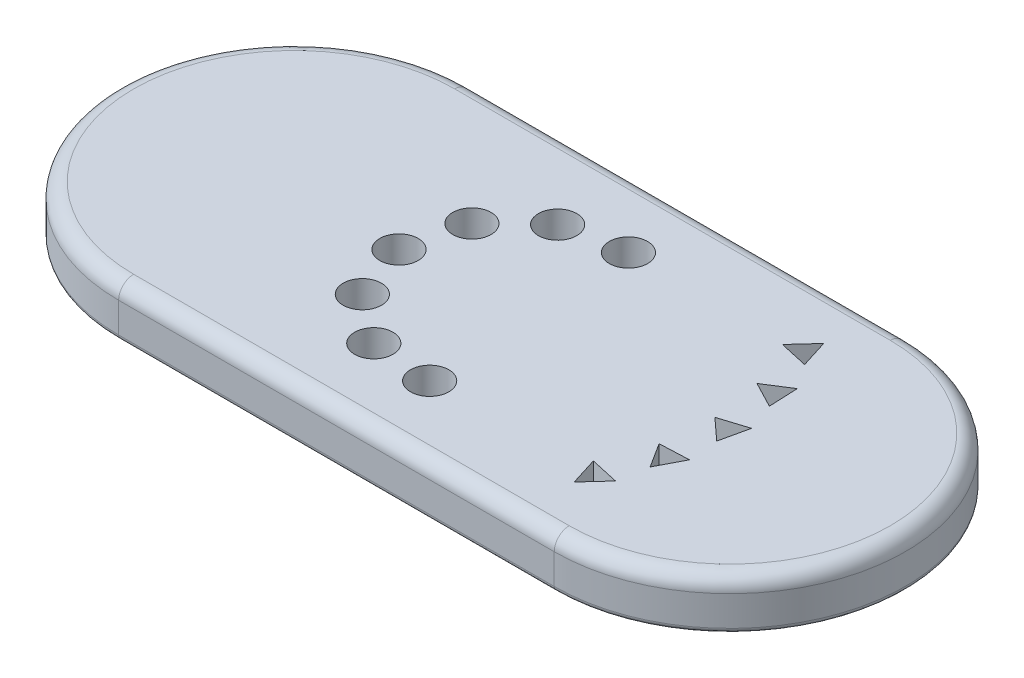
ISO-10303-21;
HEADER;
FILE_DESCRIPTION(('STEP AP214'),'2;1');
FILE_NAME('part.step','',(''),(''),'','','');
FILE_SCHEMA(('AUTOMOTIVE_DESIGN { 1 0 10303 214 1 1 1 1 }'));
ENDSEC;
DATA;
#1=APPLICATION_CONTEXT('core data for automotive mechanical design processes');
#2=APPLICATION_PROTOCOL_DEFINITION('international standard','automotive_design',2000,#1);
#3=PRODUCT_CONTEXT('',#1,'mechanical');
#4=PRODUCT('Part','Part','',(#3));
#5=PRODUCT_RELATED_PRODUCT_CATEGORY('part','',(#4));
#6=PRODUCT_DEFINITION_FORMATION('','',#4);
#7=PRODUCT_DEFINITION_CONTEXT('part definition',#1,'design');
#8=PRODUCT_DEFINITION('design','',#6,#7);
#9=PRODUCT_DEFINITION_SHAPE('','',#8);
#10=(LENGTH_UNIT() NAMED_UNIT(*) SI_UNIT(.MILLI.,.METRE.));
#11=(NAMED_UNIT(*) PLANE_ANGLE_UNIT() SI_UNIT($,.RADIAN.));
#12=(NAMED_UNIT(*) SI_UNIT($,.STERADIAN.) SOLID_ANGLE_UNIT());
#13=UNCERTAINTY_MEASURE_WITH_UNIT(LENGTH_MEASURE(1.E-05),#10,'distance_accuracy_value','');
#14=(GEOMETRIC_REPRESENTATION_CONTEXT(3) GLOBAL_UNCERTAINTY_ASSIGNED_CONTEXT((#13)) GLOBAL_UNIT_ASSIGNED_CONTEXT((#10,
#11,#12)) REPRESENTATION_CONTEXT('',''));
#15=CARTESIAN_POINT('',(0.,0.,0.));
#16=DIRECTION('',(0.,0.,1.));
#17=DIRECTION('',(1.,0.,0.));
#18=AXIS2_PLACEMENT_3D('',#15,#16,#17);
#19=CARTESIAN_POINT('',(-45.6671207444576,10.,0.));
#20=DIRECTION('',(0.,-1.,0.));
#21=DIRECTION('',(0.,0.,-1.));
#22=AXIS2_PLACEMENT_3D('',#19,#20,#21);
#23=CYLINDRICAL_SURFACE('',#22,35.0776434703805);
#24=DIRECTION('',(0.,-1.,0.));
#25=VECTOR('',#24,1.);
#26=CARTESIAN_POINT('',(-45.6671207444576,10.,-35.0776434703805));
#27=LINE('',#26,#25);
#28=CARTESIAN_POINT('',(-45.6671207444576,7.,-35.0776434703805));
#29=VERTEX_POINT('',#28);
#30=CARTESIAN_POINT('',(-45.6671207444576,0.999999999999999,-35.0776434703805));
#31=VERTEX_POINT('',#30);
#32=EDGE_CURVE('E429',#29,#31,#27,.T.);
#33=ORIENTED_EDGE('',*,*,#32,.T.);
#34=CARTESIAN_POINT('',(-45.6671207444576,0.999999999999999,0.));
#35=DIRECTION('',(0.,1.,0.));
#36=DIRECTION('',(0.,0.,1.));
#37=AXIS2_PLACEMENT_3D('',#34,#35,#36);
#38=CIRCLE('',#37,35.0776434703805);
#39=CARTESIAN_POINT('',(-45.6671207444576,0.999999999999999,35.0776434703805));
#40=VERTEX_POINT('',#39);
#41=EDGE_CURVE('E471',#31,#40,#38,.T.);
#42=ORIENTED_EDGE('',*,*,#41,.T.);
#43=DIRECTION('',(0.,-1.,0.));
#44=VECTOR('',#43,1.);
#45=CARTESIAN_POINT('',(-45.6671207444576,10.,35.0776434703805));
#46=LINE('',#45,#44);
#47=CARTESIAN_POINT('',(-45.6671207444576,7.,35.0776434703805));
#48=VERTEX_POINT('',#47);
#49=EDGE_CURVE('E442',#48,#40,#46,.T.);
#50=ORIENTED_EDGE('',*,*,#49,.F.);
#51=CARTESIAN_POINT('',(-45.6671207444576,7.,0.));
#52=DIRECTION('',(0.,1.,0.));
#53=DIRECTION('',(0.,0.,1.));
#54=AXIS2_PLACEMENT_3D('',#51,#52,#53);
#55=CIRCLE('',#54,35.0776434703805);
#56=EDGE_CURVE('E458',#48,#29,#55,.F.);
#57=ORIENTED_EDGE('',*,*,#56,.T.);
#58=EDGE_LOOP('',(#33,#42,#50,#57));
#59=FACE_BOUND('',#58,.T.);
#60=ADVANCED_FACE('F42',(#59),#23,.T.);
#61=CARTESIAN_POINT('',(-45.6671207444576,10.,35.0776434703805));
#62=DIRECTION('',(0.,0.,-1.));
#63=DIRECTION('',(-1.,0.,0.));
#64=AXIS2_PLACEMENT_3D('',#61,#62,#63);
#65=PLANE('',#64);
#66=ORIENTED_EDGE('',*,*,#49,.T.);
#67=DIRECTION('',(1.,0.,0.));
#68=VECTOR('',#67,1.);
#69=CARTESIAN_POINT('',(-45.6671207444576,0.999999999999999,35.0776434703805));
#70=LINE('',#69,#68);
#71=CARTESIAN_POINT('',(41.3651456018638,0.999999999999999,35.0776434703805));
#72=VERTEX_POINT('',#71);
#73=EDGE_CURVE('E12',#40,#72,#70,.T.);
#74=ORIENTED_EDGE('',*,*,#73,.T.);
#75=DIRECTION('',(0.,-1.,0.));
#76=VECTOR('',#75,1.);
#77=CARTESIAN_POINT('',(41.3651456018638,10.,35.0776434703805));
#78=LINE('',#77,#76);
#79=CARTESIAN_POINT('',(41.3651456018638,7.,35.0776434703805));
#80=VERTEX_POINT('',#79);
#81=EDGE_CURVE('E439',#80,#72,#78,.T.);
#82=ORIENTED_EDGE('',*,*,#81,.F.);
#83=DIRECTION('',(1.,0.,0.));
#84=VECTOR('',#83,1.);
#85=CARTESIAN_POINT('',(-45.6671207444576,7.,35.0776434703805));
#86=LINE('',#85,#84);
#87=EDGE_CURVE('E468',#80,#48,#86,.F.);
#88=ORIENTED_EDGE('',*,*,#87,.T.);
#89=EDGE_LOOP('',(#66,#74,#82,#88));
#90=FACE_BOUND('',#89,.T.);
#91=ADVANCED_FACE('F538',(#90),#65,.F.);
#92=CARTESIAN_POINT('',(41.3651456018638,10.,0.));
#93=DIRECTION('',(0.,-1.,0.));
#94=DIRECTION('',(0.,0.,-1.));
#95=AXIS2_PLACEMENT_3D('',#92,#93,#94);
#96=CYLINDRICAL_SURFACE('',#95,35.0776434703805);
#97=ORIENTED_EDGE('',*,*,#81,.T.);
#98=CARTESIAN_POINT('',(41.3651456018638,0.999999999999999,0.));
#99=DIRECTION('',(0.,1.,0.));
#100=DIRECTION('',(0.,0.,1.));
#101=AXIS2_PLACEMENT_3D('',#98,#99,#100);
#102=CIRCLE('',#101,35.0776434703805);
#103=CARTESIAN_POINT('',(41.3651456018638,0.999999999999999,-35.0776434703805));
#104=VERTEX_POINT('',#103);
#105=EDGE_CURVE('E52',#72,#104,#102,.T.);
#106=ORIENTED_EDGE('',*,*,#105,.T.);
#107=DIRECTION('',(0.,-1.,0.));
#108=VECTOR('',#107,1.);
#109=CARTESIAN_POINT('',(41.3651456018638,10.,-35.0776434703805));
#110=LINE('',#109,#108);
#111=CARTESIAN_POINT('',(41.3651456018638,7.,-35.0776434703805));
#112=VERTEX_POINT('',#111);
#113=EDGE_CURVE('E436',#112,#104,#110,.T.);
#114=ORIENTED_EDGE('',*,*,#113,.F.);
#115=CARTESIAN_POINT('',(41.3651456018638,7.,0.));
#116=DIRECTION('',(0.,1.,0.));
#117=DIRECTION('',(0.,0.,1.));
#118=AXIS2_PLACEMENT_3D('',#115,#116,#117);
#119=CIRCLE('',#118,35.0776434703805);
#120=EDGE_CURVE('E465',#112,#80,#119,.F.);
#121=ORIENTED_EDGE('',*,*,#120,.T.);
#122=EDGE_LOOP('',(#97,#106,#114,#121));
#123=FACE_BOUND('',#122,.T.);
#124=ADVANCED_FACE('F553',(#123),#96,.T.);
#125=CARTESIAN_POINT('',(-45.6671207444576,10.,-35.0776434703805));
#126=DIRECTION('',(0.,0.,1.));
#127=DIRECTION('',(1.,0.,0.));
#128=AXIS2_PLACEMENT_3D('',#125,#126,#127);
#129=PLANE('',#128);
#130=ORIENTED_EDGE('',*,*,#113,.T.);
#131=DIRECTION('',(-1.,0.,0.));
#132=VECTOR('',#131,1.);
#133=CARTESIAN_POINT('',(-45.6671207444576,0.999999999999999,-35.0776434703805));
#134=LINE('',#133,#132);
#135=EDGE_CURVE('E501',#104,#31,#134,.T.);
#136=ORIENTED_EDGE('',*,*,#135,.T.);
#137=ORIENTED_EDGE('',*,*,#32,.F.);
#138=DIRECTION('',(-1.,0.,0.));
#139=VECTOR('',#138,1.);
#140=CARTESIAN_POINT('',(41.3651456018638,7.,-35.0776434703805));
#141=LINE('',#140,#139);
#142=EDGE_CURVE('E462',#29,#112,#141,.F.);
#143=ORIENTED_EDGE('',*,*,#142,.T.);
#144=EDGE_LOOP('',(#130,#136,#137,#143));
#145=FACE_BOUND('',#144,.T.);
#146=ADVANCED_FACE('F551',(#145),#129,.F.);
#147=CARTESIAN_POINT('',(-45.6671207444576,10.,0.));
#148=DIRECTION('',(0.,1.,0.));
#149=DIRECTION('',(0.,0.,1.));
#150=AXIS2_PLACEMENT_3D('',#147,#148,#149);
#151=PLANE('',#150);
#152=DIRECTION('',(-1.,0.,0.));
#153=VECTOR('',#152,1.);
#154=CARTESIAN_POINT('',(-45.6671207444576,10.,-32.0776434703805));
#155=LINE('',#154,#153);
#156=CARTESIAN_POINT('',(41.3651456018638,10.,-32.0776434703805));
#157=VERTEX_POINT('',#156);
#158=CARTESIAN_POINT('',(-45.6671207444576,10.,-32.0776434703805));
#159=VERTEX_POINT('',#158);
#160=EDGE_CURVE('E451',#157,#159,#155,.T.);
#161=ORIENTED_EDGE('',*,*,#160,.T.);
#162=CARTESIAN_POINT('',(-45.6671207444576,10.,0.));
#163=DIRECTION('',(0.,1.,0.));
#164=DIRECTION('',(0.,0.,1.));
#165=AXIS2_PLACEMENT_3D('',#162,#163,#164);
#166=CIRCLE('',#165,32.0776434703805);
#167=CARTESIAN_POINT('',(-45.6671207444576,10.,32.0776434703805));
#168=VERTEX_POINT('',#167);
#169=EDGE_CURVE('E454',#159,#168,#166,.T.);
#170=ORIENTED_EDGE('',*,*,#169,.T.);
#171=DIRECTION('',(1.,0.,0.));
#172=VECTOR('',#171,1.);
#173=CARTESIAN_POINT('',(41.3651456018638,10.,32.0776434703805));
#174=LINE('',#173,#172);
#175=CARTESIAN_POINT('',(41.3651456018638,10.,32.0776434703805));
#176=VERTEX_POINT('',#175);
#177=EDGE_CURVE('E445',#168,#176,#174,.T.);
#178=ORIENTED_EDGE('',*,*,#177,.T.);
#179=CARTESIAN_POINT('',(41.3651456018638,10.,0.));
#180=DIRECTION('',(0.,1.,0.));
#181=DIRECTION('',(0.,0.,1.));
#182=AXIS2_PLACEMENT_3D('',#179,#180,#181);
#183=CIRCLE('',#182,32.0776434703805);
#184=EDGE_CURVE('E448',#176,#157,#183,.T.);
#185=ORIENTED_EDGE('',*,*,#184,.T.);
#186=EDGE_LOOP('',(#161,#170,#178,#185));
#187=FACE_BOUND('',#186,.T.);
#188=DIRECTION('',(0.886926625080922,0.,0.46191033948437));
#189=VECTOR('',#188,1.);
#190=CARTESIAN_POINT('',(35.4999934267407,10.,-11.2999352261753));
#191=LINE('',#190,#189);
#192=CARTESIAN_POINT('',(35.4999934267407,10.,-11.2999352261753));
#193=VERTEX_POINT('',#192);
#194=CARTESIAN_POINT('',(40.6730239839336,10.,-8.60582701782381));
#195=VERTEX_POINT('',#194);
#196=EDGE_CURVE('E207',#193,#195,#191,.T.);
#197=ORIENTED_EDGE('',*,*,#196,.F.);
#198=DIRECTION('',(-0.84348940080462,0.,0.537145818870689));
#199=VECTOR('',#198,1.);
#200=CARTESIAN_POINT('',(40.4196748543137,10.,-14.4328569990817));
#201=LINE('',#200,#199);
#202=CARTESIAN_POINT('',(40.4196748543137,10.,-14.4328569990817));
#203=VERTEX_POINT('',#202);
#204=EDGE_CURVE('E225',#203,#193,#201,.T.);
#205=ORIENTED_EDGE('',*,*,#204,.F.);
#206=DIRECTION('',(-0.0434372242763021,0.,-0.99905615835506));
#207=VECTOR('',#206,1.);
#208=CARTESIAN_POINT('',(40.6730239839336,10.,-8.60582701782381));
#209=LINE('',#208,#207);
#210=EDGE_CURVE('E229',#195,#203,#209,.T.);
#211=ORIENTED_EDGE('',*,*,#210,.F.);
#212=EDGE_LOOP('',(#197,#205,#211));
#213=FACE_BOUND('',#212,.T.);
#214=DIRECTION('',(0.737154140200738,0.,0.675724628517351));
#215=VECTOR('',#214,1.);
#216=CARTESIAN_POINT('',(37.15387447768,10.,-1.23903630891365));
#217=LINE('',#216,#215);
#218=CARTESIAN_POINT('',(37.15387447768,10.,-1.23903630891365));
#219=VERTEX_POINT('',#218);
#220=CARTESIAN_POINT('',(41.4533517791667,10.,2.70215121744924));
#221=VERTEX_POINT('',#220);
#222=EDGE_CURVE('E259',#219,#221,#217,.T.);
#223=ORIENTED_EDGE('',*,*,#222,.F.);
#224=DIRECTION('',(-0.953771764359197,0.,0.300531897660038));
#225=VECTOR('',#224,1.);
#226=CARTESIAN_POINT('',(42.7167816473319,10.,-2.99189911181428));
#227=LINE('',#226,#225);
#228=CARTESIAN_POINT('',(42.7167816473319,10.,-2.99189911181428));
#229=VERTEX_POINT('',#228);
#230=EDGE_CURVE('E250',#229,#219,#227,.T.);
#231=ORIENTED_EDGE('',*,*,#230,.F.);
#232=DIRECTION('',(0.216617624158459,0.,-0.97625652617739));
#233=VECTOR('',#232,1.);
#234=CARTESIAN_POINT('',(41.4533517791667,10.,2.70215121744924));
#235=LINE('',#234,#233);
#236=EDGE_CURVE('E262',#221,#229,#235,.T.);
#237=ORIENTED_EDGE('',*,*,#236,.F.);
#238=EDGE_LOOP('',(#223,#231,#237));
#239=FACE_BOUND('',#238,.T.);
#240=DIRECTION('',(0.537145818870688,0.,0.843489400804621));
#241=VECTOR('',#240,1.);
#242=CARTESIAN_POINT('',(36.1474486477536,10.,8.90710170527034));
#243=LINE('',#242,#241);
#244=CARTESIAN_POINT('',(36.1474486477536,10.,8.90710170527034));
#245=VERTEX_POINT('',#244);
#246=CARTESIAN_POINT('',(39.2803704206601,10.,13.8267831328433));
#247=VERTEX_POINT('',#246);
#248=EDGE_CURVE('E292',#245,#247,#243,.T.);
#249=ORIENTED_EDGE('',*,*,#248,.F.);
#250=DIRECTION('',(-0.99905615835506,0.,0.0434372242762998));
#251=VECTOR('',#250,1.);
#252=CARTESIAN_POINT('',(41.9744786290116,10.,8.65375257565046));
#253=LINE('',#252,#251);
#254=CARTESIAN_POINT('',(41.9744786290116,10.,8.65375257565046));
#255=VERTEX_POINT('',#254);
#256=EDGE_CURVE('E283',#255,#245,#253,.T.);
#257=ORIENTED_EDGE('',*,*,#256,.F.);
#258=DIRECTION('',(0.461910339484371,0.,-0.886926625080921));
#259=VECTOR('',#258,1.);
#260=CARTESIAN_POINT('',(39.2803704206601,10.,13.8267831328433));
#261=LINE('',#260,#259);
#262=EDGE_CURVE('E295',#247,#255,#261,.T.);
#263=ORIENTED_EDGE('',*,*,#262,.F.);
#264=EDGE_LOOP('',(#249,#257,#263));
#265=FACE_BOUND('',#264,.T.);
#266=DIRECTION('',(0.300531897660038,0.,0.953771764359198));
#267=VECTOR('',#266,1.);
#268=CARTESIAN_POINT('',(32.5493021940739,10.,18.4470362779959));
#269=LINE('',#268,#267);
#270=CARTESIAN_POINT('',(32.5493021940739,10.,18.4470362779959));
#271=VERTEX_POINT('',#270);
#272=CARTESIAN_POINT('',(34.3021649969745,10.,24.0099434476479));
#273=VERTEX_POINT('',#272);
#274=EDGE_CURVE('E325',#271,#273,#269,.T.);
#275=ORIENTED_EDGE('',*,*,#274,.F.);
#276=DIRECTION('',(-0.976256526177389,0.,-0.216617624158461));
#277=VECTOR('',#276,1.);
#278=CARTESIAN_POINT('',(38.2433525233374,10.,19.7104661461611));
#279=LINE('',#278,#277);
#280=CARTESIAN_POINT('',(38.2433525233374,10.,19.7104661461611));
#281=VERTEX_POINT('',#280);
#282=EDGE_CURVE('E316',#281,#271,#279,.T.);
#283=ORIENTED_EDGE('',*,*,#282,.F.);
#284=DIRECTION('',(0.675724628517351,0.,-0.737154140200737));
#285=VECTOR('',#284,1.);
#286=CARTESIAN_POINT('',(34.3021649969745,10.,24.0099434476479));
#287=LINE('',#286,#285);
#288=EDGE_CURVE('E328',#273,#281,#287,.T.);
#289=ORIENTED_EDGE('',*,*,#288,.F.);
#290=EDGE_LOOP('',(#275,#283,#289));
#291=FACE_BOUND('',#290,.T.);
#292=DIRECTION('',(0.97625652617739,0.,0.216617624158458));
#293=VECTOR('',#292,1.);
#294=CARTESIAN_POINT('',(31.2985147553897,10.,-20.5899614117248));
#295=LINE('',#294,#293);
#296=CARTESIAN_POINT('',(31.2985147553897,10.,-20.5899614117248));
#297=VERTEX_POINT('',#296);
#298=CARTESIAN_POINT('',(36.9925650846533,10.,-19.3265315435595));
#299=VERTEX_POINT('',#298);
#300=EDGE_CURVE('E242',#297,#299,#295,.T.);
#301=ORIENTED_EDGE('',*,*,#300,.F.);
#302=DIRECTION('',(-0.67572462851735,0.,0.737154140200738));
#303=VECTOR('',#302,1.);
#304=CARTESIAN_POINT('',(35.2397022817526,10.,-24.8894387132115));
#305=LINE('',#304,#303);
#306=CARTESIAN_POINT('',(35.2397022817526,10.,-24.8894387132115));
#307=VERTEX_POINT('',#306);
#308=EDGE_CURVE('E349',#307,#297,#305,.T.);
#309=ORIENTED_EDGE('',*,*,#308,.F.);
#310=DIRECTION('',(-0.300531897660041,0.,-0.953771764359197));
#311=VECTOR('',#310,1.);
#312=CARTESIAN_POINT('',(36.9925650846533,10.,-19.3265315435595));
#313=LINE('',#312,#311);
#314=EDGE_CURVE('E360',#299,#307,#313,.T.);
#315=ORIENTED_EDGE('',*,*,#314,.F.);
#316=EDGE_LOOP('',(#301,#309,#315));
#317=FACE_BOUND('',#316,.T.);
#318=CARTESIAN_POINT('',(-11.9019677543946,10.,-18.8695098053727));
#319=DIRECTION('',(0.,1.,0.));
#320=DIRECTION('',(0.544639035015028,0.,0.838670567945423));
#321=AXIS2_PLACEMENT_3D('',#318,#319,#320);
#322=CIRCLE('',#321,3.82970639069155);
#323=CARTESIAN_POINT('',(-9.81616016137746,10.,-15.6576477716272));
#324=VERTEX_POINT('',#323);
#325=EDGE_CURVE('E382',#324,#324,#322,.T.);
#326=ORIENTED_EDGE('',*,*,#325,.F.);
#327=EDGE_LOOP('',(#326));
#328=FACE_BOUND('',#327,.T.);
#329=CARTESIAN_POINT('',(-20.6609172871312,10.,-10.5041626997556));
#330=DIRECTION('',(0.,1.,0.));
#331=DIRECTION('',(0.913545457642602,0.,0.406736643075798));
#332=AXIS2_PLACEMENT_3D('',#329,#330,#331);
#333=CIRCLE('',#332,3.82970639069155);
#334=CARTESIAN_POINT('',(-17.1623064098101,10.,-8.94648077843977));
#335=VERTEX_POINT('',#334);
#336=EDGE_CURVE('E390',#335,#335,#333,.T.);
#337=ORIENTED_EDGE('',*,*,#336,.F.);
#338=EDGE_LOOP('',(#337));
#339=FACE_BOUND('',#338,.T.);
#340=CARTESIAN_POINT('',(-23.4506958911877,10.,1.28207352962794));
#341=DIRECTION('',(0.,1.,0.));
#342=DIRECTION('',(0.987688340595137,0.,-0.156434465040234));
#343=AXIS2_PLACEMENT_3D('',#340,#341,#342);
#344=CIRCLE('',#343,3.82970639069155);
#345=CARTESIAN_POINT('',(-19.668139541199,10.,0.682975459138944));
#346=VERTEX_POINT('',#345);
#347=EDGE_CURVE('E398',#346,#346,#344,.T.);
#348=ORIENTED_EDGE('',*,*,#347,.F.);
#349=EDGE_LOOP('',(#348));
#350=FACE_BOUND('',#349,.T.);
#351=CARTESIAN_POINT('',(-19.3711567710631,10.,12.6862652888828));
#352=DIRECTION('',(0.,1.,0.));
#353=DIRECTION('',(0.743144825477392,0.,-0.669130606358861));
#354=AXIS2_PLACEMENT_3D('',#351,#352,#353);
#355=CIRCLE('',#354,3.82970639069155);
#356=CARTESIAN_POINT('',(-16.525130283723,10.,10.123691529503));
#357=VERTEX_POINT('',#356);
#358=EDGE_CURVE('E406',#357,#357,#355,.T.);
#359=ORIENTED_EDGE('',*,*,#358,.F.);
#360=EDGE_LOOP('',(#359));
#361=FACE_BOUND('',#360,.T.);
#362=CARTESIAN_POINT('',(-9.73859938534576,10.,20.0287490188849));
#363=DIRECTION('',(0.,1.,0.));
#364=DIRECTION('',(0.258819045102516,0.,-0.96592582628907));
#365=AXIS2_PLACEMENT_3D('',#362,#363,#364);
#366=CIRCLE('',#365,3.82970639069155);
#367=CARTESIAN_POINT('',(-8.74739843428397,10.,16.3295367090117));
#368=VERTEX_POINT('',#367);
#369=EDGE_CURVE('E414',#368,#368,#366,.T.);
#370=ORIENTED_EDGE('',*,*,#369,.F.);
#371=EDGE_LOOP('',(#370));
#372=FACE_BOUND('',#371,.T.);
#373=CARTESIAN_POINT('',(2.3389462414226,10.,20.9404072595719));
#374=DIRECTION('',(0.,1.,0.));
#375=DIRECTION('',(-0.309016994374953,0.,-0.951056516295152));
#376=AXIS2_PLACEMENT_3D('',#373,#374,#375);
#377=CIRCLE('',#376,3.82970639069155);
#378=CARTESIAN_POINT('',(1.15550188323255,10.,17.2981400412075));
#379=VERTEX_POINT('',#378);
#380=EDGE_CURVE('E370',#379,#379,#377,.T.);
#381=ORIENTED_EDGE('',*,*,#380,.F.);
#382=EDGE_LOOP('',(#381));
#383=FACE_BOUND('',#382,.T.);
#384=CARTESIAN_POINT('',(0.,10.,-21.1148143922462));
#385=DIRECTION('',(0.,1.,0.));
#386=DIRECTION('',(0.,0.,1.));
#387=AXIS2_PLACEMENT_3D('',#384,#385,#386);
#388=CIRCLE('',#387,3.82970639069155);
#389=CARTESIAN_POINT('',(0.,10.,-17.2851080015546));
#390=VERTEX_POINT('',#389);
#391=EDGE_CURVE('E381',#390,#390,#388,.T.);
#392=ORIENTED_EDGE('',*,*,#391,.F.);
#393=EDGE_LOOP('',(#392));
#394=FACE_BOUND('',#393,.T.);
#395=ADVANCED_FACE('F562',(#187,#213,#239,#265,#291,#317,#328,#339,#350,#361,#372,#383,#394),
#151,.T.);
#396=CARTESIAN_POINT('',(-45.6671207444576,0.,0.));
#397=DIRECTION('',(0.,1.,0.));
#398=DIRECTION('',(0.,0.,1.));
#399=AXIS2_PLACEMENT_3D('',#396,#397,#398);
#400=PLANE('',#399);
#401=DIRECTION('',(1.,0.,0.));
#402=VECTOR('',#401,1.);
#403=CARTESIAN_POINT('',(-45.6671207444576,0.,34.0776434703805));
#404=LINE('',#403,#402);
#405=CARTESIAN_POINT('',(41.3651456018638,0.,34.0776434703805));
#406=VERTEX_POINT('',#405);
#407=CARTESIAN_POINT('',(-45.6671207444576,0.,34.0776434703805));
#408=VERTEX_POINT('',#407);
#409=EDGE_CURVE('E488',#406,#408,#404,.F.);
#410=ORIENTED_EDGE('',*,*,#409,.T.);
#411=CARTESIAN_POINT('',(-45.6671207444576,0.,0.));
#412=DIRECTION('',(0.,1.,0.));
#413=DIRECTION('',(0.,0.,1.));
#414=AXIS2_PLACEMENT_3D('',#411,#412,#413);
#415=CIRCLE('',#414,34.0776434703805);
#416=CARTESIAN_POINT('',(-45.6671207444576,0.,-34.0776434703805));
#417=VERTEX_POINT('',#416);
#418=EDGE_CURVE('E497',#408,#417,#415,.F.);
#419=ORIENTED_EDGE('',*,*,#418,.T.);
#420=DIRECTION('',(-1.,0.,0.));
#421=VECTOR('',#420,1.);
#422=CARTESIAN_POINT('',(-45.6671207444576,0.,-34.0776434703805));
#423=LINE('',#422,#421);
#424=CARTESIAN_POINT('',(41.3651456018638,0.,-34.0776434703805));
#425=VERTEX_POINT('',#424);
#426=EDGE_CURVE('E494',#417,#425,#423,.F.);
#427=ORIENTED_EDGE('',*,*,#426,.T.);
#428=CARTESIAN_POINT('',(41.3651456018638,0.,0.));
#429=DIRECTION('',(0.,1.,0.));
#430=DIRECTION('',(0.,0.,1.));
#431=AXIS2_PLACEMENT_3D('',#428,#429,#430);
#432=CIRCLE('',#431,34.0776434703805);
#433=EDGE_CURVE('E491',#425,#406,#432,.F.);
#434=ORIENTED_EDGE('',*,*,#433,.T.);
#435=EDGE_LOOP('',(#410,#419,#427,#434));
#436=FACE_BOUND('',#435,.T.);
#437=DIRECTION('',(-0.84348940080462,0.,0.537145818870689));
#438=VECTOR('',#437,1.);
#439=CARTESIAN_POINT('',(40.4196748543137,0.,-14.4328569990817));
#440=LINE('',#439,#438);
#441=CARTESIAN_POINT('',(40.4196748543137,0.,-14.4328569990817));
#442=VERTEX_POINT('',#441);
#443=CARTESIAN_POINT('',(35.4999934267407,0.,-11.2999352261753));
#444=VERTEX_POINT('',#443);
#445=EDGE_CURVE('E213',#442,#444,#440,.T.);
#446=ORIENTED_EDGE('',*,*,#445,.T.);
#447=DIRECTION('',(0.886926625080922,0.,0.46191033948437));
#448=VECTOR('',#447,1.);
#449=CARTESIAN_POINT('',(35.4999934267407,0.,-11.2999352261753));
#450=LINE('',#449,#448);
#451=CARTESIAN_POINT('',(40.6730239839336,0.,-8.60582701782381));
#452=VERTEX_POINT('',#451);
#453=EDGE_CURVE('E204',#444,#452,#450,.T.);
#454=ORIENTED_EDGE('',*,*,#453,.T.);
#455=DIRECTION('',(-0.0434372242763021,0.,-0.99905615835506));
#456=VECTOR('',#455,1.);
#457=CARTESIAN_POINT('',(40.6730239839336,0.,-8.60582701782381));
#458=LINE('',#457,#456);
#459=EDGE_CURVE('E217',#452,#442,#458,.T.);
#460=ORIENTED_EDGE('',*,*,#459,.T.);
#461=EDGE_LOOP('',(#446,#454,#460));
#462=FACE_BOUND('',#461,.T.);
#463=DIRECTION('',(-0.953771764359197,0.,0.300531897660038));
#464=VECTOR('',#463,1.);
#465=CARTESIAN_POINT('',(42.7167816473319,0.,-2.99189911181428));
#466=LINE('',#465,#464);
#467=CARTESIAN_POINT('',(42.7167816473319,0.,-2.99189911181428));
#468=VERTEX_POINT('',#467);
#469=CARTESIAN_POINT('',(37.15387447768,0.,-1.23903630891365));
#470=VERTEX_POINT('',#469);
#471=EDGE_CURVE('E254',#468,#470,#466,.T.);
#472=ORIENTED_EDGE('',*,*,#471,.T.);
#473=DIRECTION('',(0.737154140200738,0.,0.675724628517351));
#474=VECTOR('',#473,1.);
#475=CARTESIAN_POINT('',(37.15387447768,0.,-1.23903630891365));
#476=LINE('',#475,#474);
#477=CARTESIAN_POINT('',(41.4533517791667,0.,2.70215121744924));
#478=VERTEX_POINT('',#477);
#479=EDGE_CURVE('E245',#470,#478,#476,.T.);
#480=ORIENTED_EDGE('',*,*,#479,.T.);
#481=DIRECTION('',(0.216617624158459,0.,-0.97625652617739));
#482=VECTOR('',#481,1.);
#483=CARTESIAN_POINT('',(41.4533517791667,0.,2.70215121744924));
#484=LINE('',#483,#482);
#485=EDGE_CURVE('E249',#478,#468,#484,.T.);
#486=ORIENTED_EDGE('',*,*,#485,.T.);
#487=EDGE_LOOP('',(#472,#480,#486));
#488=FACE_BOUND('',#487,.T.);
#489=DIRECTION('',(-0.99905615835506,0.,0.0434372242762998));
#490=VECTOR('',#489,1.);
#491=CARTESIAN_POINT('',(41.9744786290116,0.,8.65375257565046));
#492=LINE('',#491,#490);
#493=CARTESIAN_POINT('',(41.9744786290116,0.,8.65375257565046));
#494=VERTEX_POINT('',#493);
#495=CARTESIAN_POINT('',(36.1474486477536,0.,8.90710170527034));
#496=VERTEX_POINT('',#495);
#497=EDGE_CURVE('E287',#494,#496,#492,.T.);
#498=ORIENTED_EDGE('',*,*,#497,.T.);
#499=DIRECTION('',(0.537145818870688,0.,0.843489400804621));
#500=VECTOR('',#499,1.);
#501=CARTESIAN_POINT('',(36.1474486477536,0.,8.90710170527034));
#502=LINE('',#501,#500);
#503=CARTESIAN_POINT('',(39.2803704206601,0.,13.8267831328433));
#504=VERTEX_POINT('',#503);
#505=EDGE_CURVE('E278',#496,#504,#502,.T.);
#506=ORIENTED_EDGE('',*,*,#505,.T.);
#507=DIRECTION('',(0.461910339484371,0.,-0.886926625080921));
#508=VECTOR('',#507,1.);
#509=CARTESIAN_POINT('',(39.2803704206601,0.,13.8267831328433));
#510=LINE('',#509,#508);
#511=EDGE_CURVE('E282',#504,#494,#510,.T.);
#512=ORIENTED_EDGE('',*,*,#511,.T.);
#513=EDGE_LOOP('',(#498,#506,#512));
#514=FACE_BOUND('',#513,.T.);
#515=DIRECTION('',(-0.976256526177389,0.,-0.216617624158461));
#516=VECTOR('',#515,1.);
#517=CARTESIAN_POINT('',(38.2433525233374,0.,19.7104661461611));
#518=LINE('',#517,#516);
#519=CARTESIAN_POINT('',(38.2433525233374,0.,19.7104661461611));
#520=VERTEX_POINT('',#519);
#521=CARTESIAN_POINT('',(32.5493021940739,0.,18.4470362779959));
#522=VERTEX_POINT('',#521);
#523=EDGE_CURVE('E320',#520,#522,#518,.T.);
#524=ORIENTED_EDGE('',*,*,#523,.T.);
#525=DIRECTION('',(0.300531897660038,0.,0.953771764359198));
#526=VECTOR('',#525,1.);
#527=CARTESIAN_POINT('',(32.5493021940739,0.,18.4470362779959));
#528=LINE('',#527,#526);
#529=CARTESIAN_POINT('',(34.3021649969745,0.,24.0099434476479));
#530=VERTEX_POINT('',#529);
#531=EDGE_CURVE('E311',#522,#530,#528,.T.);
#532=ORIENTED_EDGE('',*,*,#531,.T.);
#533=DIRECTION('',(0.675724628517351,0.,-0.737154140200737));
#534=VECTOR('',#533,1.);
#535=CARTESIAN_POINT('',(34.3021649969745,0.,24.0099434476479));
#536=LINE('',#535,#534);
#537=EDGE_CURVE('E315',#530,#520,#536,.T.);
#538=ORIENTED_EDGE('',*,*,#537,.T.);
#539=EDGE_LOOP('',(#524,#532,#538));
#540=FACE_BOUND('',#539,.T.);
#541=DIRECTION('',(-0.67572462851735,0.,0.737154140200738));
#542=VECTOR('',#541,1.);
#543=CARTESIAN_POINT('',(35.2397022817526,0.,-24.8894387132115));
#544=LINE('',#543,#542);
#545=CARTESIAN_POINT('',(35.2397022817526,0.,-24.8894387132115));
#546=VERTEX_POINT('',#545);
#547=CARTESIAN_POINT('',(31.2985147553897,0.,-20.5899614117248));
#548=VERTEX_POINT('',#547);
#549=EDGE_CURVE('E353',#546,#548,#544,.T.);
#550=ORIENTED_EDGE('',*,*,#549,.T.);
#551=DIRECTION('',(0.97625652617739,0.,0.216617624158458));
#552=VECTOR('',#551,1.);
#553=CARTESIAN_POINT('',(31.2985147553897,0.,-20.5899614117248));
#554=LINE('',#553,#552);
#555=CARTESIAN_POINT('',(36.9925650846533,0.,-19.3265315435595));
#556=VERTEX_POINT('',#555);
#557=EDGE_CURVE('E344',#548,#556,#554,.T.);
#558=ORIENTED_EDGE('',*,*,#557,.T.);
#559=DIRECTION('',(-0.300531897660041,0.,-0.953771764359197));
#560=VECTOR('',#559,1.);
#561=CARTESIAN_POINT('',(36.9925650846533,0.,-19.3265315435595));
#562=LINE('',#561,#560);
#563=EDGE_CURVE('E348',#556,#546,#562,.T.);
#564=ORIENTED_EDGE('',*,*,#563,.T.);
#565=EDGE_LOOP('',(#550,#558,#564));
#566=FACE_BOUND('',#565,.T.);
#567=CARTESIAN_POINT('',(-11.9019677543946,0.,-18.8695098053727));
#568=DIRECTION('',(0.,1.,0.));
#569=DIRECTION('',(0.544639035015028,0.,0.838670567945423));
#570=AXIS2_PLACEMENT_3D('',#567,#568,#569);
#571=CIRCLE('',#570,3.82970639069155);
#572=CARTESIAN_POINT('',(-9.81616016137746,0.,-15.6576477716272));
#573=VERTEX_POINT('',#572);
#574=EDGE_CURVE('E377',#573,#573,#571,.T.);
#575=ORIENTED_EDGE('',*,*,#574,.T.);
#576=EDGE_LOOP('',(#575));
#577=FACE_BOUND('',#576,.T.);
#578=CARTESIAN_POINT('',(-20.6609172871312,0.,-10.5041626997556));
#579=DIRECTION('',(0.,1.,0.));
#580=DIRECTION('',(0.913545457642602,0.,0.406736643075798));
#581=AXIS2_PLACEMENT_3D('',#578,#579,#580);
#582=CIRCLE('',#581,3.82970639069155);
#583=CARTESIAN_POINT('',(-17.1623064098101,0.,-8.94648077843977));
#584=VERTEX_POINT('',#583);
#585=EDGE_CURVE('E386',#584,#584,#582,.T.);
#586=ORIENTED_EDGE('',*,*,#585,.T.);
#587=EDGE_LOOP('',(#586));
#588=FACE_BOUND('',#587,.T.);
#589=CARTESIAN_POINT('',(-23.4506958911877,0.,1.28207352962794));
#590=DIRECTION('',(0.,1.,0.));
#591=DIRECTION('',(0.987688340595137,0.,-0.156434465040234));
#592=AXIS2_PLACEMENT_3D('',#589,#590,#591);
#593=CIRCLE('',#592,3.82970639069155);
#594=CARTESIAN_POINT('',(-19.668139541199,0.,0.682975459138944));
#595=VERTEX_POINT('',#594);
#596=EDGE_CURVE('E394',#595,#595,#593,.T.);
#597=ORIENTED_EDGE('',*,*,#596,.T.);
#598=EDGE_LOOP('',(#597));
#599=FACE_BOUND('',#598,.T.);
#600=CARTESIAN_POINT('',(-19.3711567710631,0.,12.6862652888828));
#601=DIRECTION('',(0.,1.,0.));
#602=DIRECTION('',(0.743144825477392,0.,-0.669130606358861));
#603=AXIS2_PLACEMENT_3D('',#600,#601,#602);
#604=CIRCLE('',#603,3.82970639069155);
#605=CARTESIAN_POINT('',(-16.525130283723,0.,10.123691529503));
#606=VERTEX_POINT('',#605);
#607=EDGE_CURVE('E402',#606,#606,#604,.T.);
#608=ORIENTED_EDGE('',*,*,#607,.T.);
#609=EDGE_LOOP('',(#608));
#610=FACE_BOUND('',#609,.T.);
#611=CARTESIAN_POINT('',(-9.73859938534576,0.,20.0287490188849));
#612=DIRECTION('',(0.,1.,0.));
#613=DIRECTION('',(0.258819045102516,0.,-0.96592582628907));
#614=AXIS2_PLACEMENT_3D('',#611,#612,#613);
#615=CIRCLE('',#614,3.82970639069155);
#616=CARTESIAN_POINT('',(-8.74739843428397,0.,16.3295367090117));
#617=VERTEX_POINT('',#616);
#618=EDGE_CURVE('E410',#617,#617,#615,.T.);
#619=ORIENTED_EDGE('',*,*,#618,.T.);
#620=EDGE_LOOP('',(#619));
#621=FACE_BOUND('',#620,.T.);
#622=CARTESIAN_POINT('',(2.3389462414226,0.,20.9404072595719));
#623=DIRECTION('',(0.,1.,0.));
#624=DIRECTION('',(-0.309016994374953,0.,-0.951056516295152));
#625=AXIS2_PLACEMENT_3D('',#622,#623,#624);
#626=CIRCLE('',#625,3.82970639069155);
#627=CARTESIAN_POINT('',(1.15550188323255,0.,17.2981400412075));
#628=VERTEX_POINT('',#627);
#629=EDGE_CURVE('E418',#628,#628,#626,.T.);
#630=ORIENTED_EDGE('',*,*,#629,.T.);
#631=EDGE_LOOP('',(#630));
#632=FACE_BOUND('',#631,.T.);
#633=CARTESIAN_POINT('',(0.,0.,-21.1148143922462));
#634=DIRECTION('',(0.,1.,0.));
#635=DIRECTION('',(0.,0.,1.));
#636=AXIS2_PLACEMENT_3D('',#633,#634,#635);
#637=CIRCLE('',#636,3.82970639069155);
#638=CARTESIAN_POINT('',(0.,0.,-17.2851080015546));
#639=VERTEX_POINT('',#638);
#640=EDGE_CURVE('E425',#639,#639,#637,.T.);
#641=ORIENTED_EDGE('',*,*,#640,.T.);
#642=EDGE_LOOP('',(#641));
#643=FACE_BOUND('',#642,.T.);
#644=ADVANCED_FACE('F222',(#436,#462,#488,#514,#540,#566,#577,#588,#599,#610,#621,#632,#643),
#400,.F.);
#645=CARTESIAN_POINT('',(0.,0.,-21.1148143922462));
#646=DIRECTION('',(0.,1.,0.));
#647=DIRECTION('',(0.,0.,1.));
#648=AXIS2_PLACEMENT_3D('',#645,#646,#647);
#649=CYLINDRICAL_SURFACE('',#648,3.82970639069155);
#650=ORIENTED_EDGE('',*,*,#640,.F.);
#651=EDGE_LOOP('',(#650));
#652=FACE_BOUND('',#651,.T.);
#653=ORIENTED_EDGE('',*,*,#391,.T.);
#654=EDGE_LOOP('',(#653));
#655=FACE_BOUND('',#654,.T.);
#656=ADVANCED_FACE('F598',(#652,#655),#649,.F.);
#657=CARTESIAN_POINT('',(2.3389462414226,0.,20.9404072595719));
#658=DIRECTION('',(0.,1.,0.));
#659=DIRECTION('',(0.,0.,1.));
#660=AXIS2_PLACEMENT_3D('',#657,#658,#659);
#661=CYLINDRICAL_SURFACE('',#660,3.82970639069155);
#662=ORIENTED_EDGE('',*,*,#629,.F.);
#663=EDGE_LOOP('',(#662));
#664=FACE_BOUND('',#663,.T.);
#665=ORIENTED_EDGE('',*,*,#380,.T.);
#666=EDGE_LOOP('',(#665));
#667=FACE_BOUND('',#666,.T.);
#668=ADVANCED_FACE('F600',(#664,#667),#661,.F.);
#669=CARTESIAN_POINT('',(-9.73859938534576,0.,20.0287490188849));
#670=DIRECTION('',(0.,1.,0.));
#671=DIRECTION('',(0.,0.,1.));
#672=AXIS2_PLACEMENT_3D('',#669,#670,#671);
#673=CYLINDRICAL_SURFACE('',#672,3.82970639069155);
#674=ORIENTED_EDGE('',*,*,#618,.F.);
#675=EDGE_LOOP('',(#674));
#676=FACE_BOUND('',#675,.T.);
#677=ORIENTED_EDGE('',*,*,#369,.T.);
#678=EDGE_LOOP('',(#677));
#679=FACE_BOUND('',#678,.T.);
#680=ADVANCED_FACE('F607',(#676,#679),#673,.F.);
#681=CARTESIAN_POINT('',(-19.3711567710631,0.,12.6862652888828));
#682=DIRECTION('',(0.,1.,0.));
#683=DIRECTION('',(0.,0.,1.));
#684=AXIS2_PLACEMENT_3D('',#681,#682,#683);
#685=CYLINDRICAL_SURFACE('',#684,3.82970639069155);
#686=ORIENTED_EDGE('',*,*,#607,.F.);
#687=EDGE_LOOP('',(#686));
#688=FACE_BOUND('',#687,.T.);
#689=ORIENTED_EDGE('',*,*,#358,.T.);
#690=EDGE_LOOP('',(#689));
#691=FACE_BOUND('',#690,.T.);
#692=ADVANCED_FACE('F794',(#688,#691),#685,.F.);
#693=CARTESIAN_POINT('',(-23.4506958911877,0.,1.28207352962794));
#694=DIRECTION('',(0.,1.,0.));
#695=DIRECTION('',(0.,0.,1.));
#696=AXIS2_PLACEMENT_3D('',#693,#694,#695);
#697=CYLINDRICAL_SURFACE('',#696,3.82970639069155);
#698=ORIENTED_EDGE('',*,*,#596,.F.);
#699=EDGE_LOOP('',(#698));
#700=FACE_BOUND('',#699,.T.);
#701=ORIENTED_EDGE('',*,*,#347,.T.);
#702=EDGE_LOOP('',(#701));
#703=FACE_BOUND('',#702,.T.);
#704=ADVANCED_FACE('F786',(#700,#703),#697,.F.);
#705=CARTESIAN_POINT('',(-20.6609172871312,0.,-10.5041626997556));
#706=DIRECTION('',(0.,1.,0.));
#707=DIRECTION('',(0.,0.,1.));
#708=AXIS2_PLACEMENT_3D('',#705,#706,#707);
#709=CYLINDRICAL_SURFACE('',#708,3.82970639069155);
#710=ORIENTED_EDGE('',*,*,#585,.F.);
#711=EDGE_LOOP('',(#710));
#712=FACE_BOUND('',#711,.T.);
#713=ORIENTED_EDGE('',*,*,#336,.T.);
#714=EDGE_LOOP('',(#713));
#715=FACE_BOUND('',#714,.T.);
#716=ADVANCED_FACE('F778',(#712,#715),#709,.F.);
#717=CARTESIAN_POINT('',(-11.9019677543946,0.,-18.8695098053727));
#718=DIRECTION('',(0.,1.,0.));
#719=DIRECTION('',(0.,0.,1.));
#720=AXIS2_PLACEMENT_3D('',#717,#718,#719);
#721=CYLINDRICAL_SURFACE('',#720,3.82970639069155);
#722=ORIENTED_EDGE('',*,*,#574,.F.);
#723=EDGE_LOOP('',(#722));
#724=FACE_BOUND('',#723,.T.);
#725=ORIENTED_EDGE('',*,*,#325,.T.);
#726=EDGE_LOOP('',(#725));
#727=FACE_BOUND('',#726,.T.);
#728=ADVANCED_FACE('F770',(#724,#727),#721,.F.);
#729=CARTESIAN_POINT('',(31.2985147553897,0.,-20.5899614117248));
#730=DIRECTION('',(-0.216617624158458,0.,0.97625652617739));
#731=DIRECTION('',(0.97625652617739,0.,0.216617624158458));
#732=AXIS2_PLACEMENT_3D('',#729,#730,#731);
#733=PLANE('',#732);
#734=ORIENTED_EDGE('',*,*,#300,.T.);
#735=DIRECTION('',(0.,1.,0.));
#736=VECTOR('',#735,1.);
#737=CARTESIAN_POINT('',(36.9925650846533,0.,-19.3265315435595));
#738=LINE('',#737,#736);
#739=EDGE_CURVE('E357',#556,#299,#738,.T.);
#740=ORIENTED_EDGE('',*,*,#739,.F.);
#741=ORIENTED_EDGE('',*,*,#557,.F.);
#742=DIRECTION('',(0.,1.,0.));
#743=VECTOR('',#742,1.);
#744=CARTESIAN_POINT('',(31.2985147553897,0.,-20.5899614117248));
#745=LINE('',#744,#743);
#746=EDGE_CURVE('E367',#548,#297,#745,.T.);
#747=ORIENTED_EDGE('',*,*,#746,.T.);
#748=EDGE_LOOP('',(#734,#740,#741,#747));
#749=FACE_BOUND('',#748,.T.);
#750=ADVANCED_FACE('F762',(#749),#733,.F.);
#751=CARTESIAN_POINT('',(35.2397022817526,0.,-24.8894387132115));
#752=DIRECTION('',(-0.737154140200738,0.,-0.67572462851735));
#753=DIRECTION('',(-0.67572462851735,0.,0.737154140200738));
#754=AXIS2_PLACEMENT_3D('',#751,#752,#753);
#755=PLANE('',#754);
#756=ORIENTED_EDGE('',*,*,#308,.T.);
#757=ORIENTED_EDGE('',*,*,#746,.F.);
#758=ORIENTED_EDGE('',*,*,#549,.F.);
#759=DIRECTION('',(0.,1.,0.));
#760=VECTOR('',#759,1.);
#761=CARTESIAN_POINT('',(35.2397022817526,0.,-24.8894387132115));
#762=LINE('',#761,#760);
#763=EDGE_CURVE('E371',#546,#307,#762,.T.);
#764=ORIENTED_EDGE('',*,*,#763,.T.);
#765=EDGE_LOOP('',(#756,#757,#758,#764));
#766=FACE_BOUND('',#765,.T.);
#767=ADVANCED_FACE('F754',(#766),#755,.F.);
#768=CARTESIAN_POINT('',(36.9925650846533,0.,-19.3265315435595));
#769=DIRECTION('',(0.953771764359197,0.,-0.300531897660041));
#770=DIRECTION('',(-0.300531897660041,0.,-0.953771764359197));
#771=AXIS2_PLACEMENT_3D('',#768,#769,#770);
#772=PLANE('',#771);
#773=ORIENTED_EDGE('',*,*,#314,.T.);
#774=ORIENTED_EDGE('',*,*,#763,.F.);
#775=ORIENTED_EDGE('',*,*,#563,.F.);
#776=ORIENTED_EDGE('',*,*,#739,.T.);
#777=EDGE_LOOP('',(#773,#774,#775,#776));
#778=FACE_BOUND('',#777,.T.);
#779=ADVANCED_FACE('F746',(#778),#772,.F.);
#780=CARTESIAN_POINT('',(32.5493021940739,0.,18.4470362779959));
#781=DIRECTION('',(-0.953771764359197,0.,0.300531897660038));
#782=DIRECTION('',(0.300531897660038,0.,0.953771764359197));
#783=AXIS2_PLACEMENT_3D('',#780,#781,#782);
#784=PLANE('',#783);
#785=ORIENTED_EDGE('',*,*,#274,.T.);
#786=DIRECTION('',(0.,1.,0.));
#787=VECTOR('',#786,1.);
#788=CARTESIAN_POINT('',(34.3021649969745,0.,24.0099434476479));
#789=LINE('',#788,#787);
#790=EDGE_CURVE('E324',#530,#273,#789,.T.);
#791=ORIENTED_EDGE('',*,*,#790,.F.);
#792=ORIENTED_EDGE('',*,*,#531,.F.);
#793=DIRECTION('',(0.,1.,0.));
#794=VECTOR('',#793,1.);
#795=CARTESIAN_POINT('',(32.5493021940739,0.,18.4470362779959));
#796=LINE('',#795,#794);
#797=EDGE_CURVE('E296',#522,#271,#796,.T.);
#798=ORIENTED_EDGE('',*,*,#797,.T.);
#799=EDGE_LOOP('',(#785,#791,#792,#798));
#800=FACE_BOUND('',#799,.T.);
#801=ADVANCED_FACE('F738',(#800),#784,.F.);
#802=CARTESIAN_POINT('',(38.2433525233374,0.,19.7104661461611));
#803=DIRECTION('',(0.216617624158461,0.,-0.976256526177389));
#804=DIRECTION('',(-0.976256526177389,0.,-0.216617624158461));
#805=AXIS2_PLACEMENT_3D('',#802,#803,#804);
#806=PLANE('',#805);
#807=ORIENTED_EDGE('',*,*,#282,.T.);
#808=ORIENTED_EDGE('',*,*,#797,.F.);
#809=ORIENTED_EDGE('',*,*,#523,.F.);
#810=DIRECTION('',(0.,1.,0.));
#811=VECTOR('',#810,1.);
#812=CARTESIAN_POINT('',(38.2433525233374,0.,19.7104661461611));
#813=LINE('',#812,#811);
#814=EDGE_CURVE('E338',#520,#281,#813,.T.);
#815=ORIENTED_EDGE('',*,*,#814,.T.);
#816=EDGE_LOOP('',(#807,#808,#809,#815));
#817=FACE_BOUND('',#816,.T.);
#818=ADVANCED_FACE('F730',(#817),#806,.F.);
#819=CARTESIAN_POINT('',(34.3021649969745,0.,24.0099434476479));
#820=DIRECTION('',(0.737154140200737,0.,0.675724628517351));
#821=DIRECTION('',(0.675724628517351,0.,-0.737154140200737));
#822=AXIS2_PLACEMENT_3D('',#819,#820,#821);
#823=PLANE('',#822);
#824=ORIENTED_EDGE('',*,*,#288,.T.);
#825=ORIENTED_EDGE('',*,*,#814,.F.);
#826=ORIENTED_EDGE('',*,*,#537,.F.);
#827=ORIENTED_EDGE('',*,*,#790,.T.);
#828=EDGE_LOOP('',(#824,#825,#826,#827));
#829=FACE_BOUND('',#828,.T.);
#830=ADVANCED_FACE('F722',(#829),#823,.F.);
#831=CARTESIAN_POINT('',(36.1474486477536,0.,8.90710170527034));
#832=DIRECTION('',(-0.843489400804621,0.,0.537145818870688));
#833=DIRECTION('',(0.537145818870688,0.,0.843489400804621));
#834=AXIS2_PLACEMENT_3D('',#831,#832,#833);
#835=PLANE('',#834);
#836=ORIENTED_EDGE('',*,*,#248,.T.);
#837=DIRECTION('',(0.,1.,0.));
#838=VECTOR('',#837,1.);
#839=CARTESIAN_POINT('',(39.2803704206601,0.,13.8267831328433));
#840=LINE('',#839,#838);
#841=EDGE_CURVE('E291',#504,#247,#840,.T.);
#842=ORIENTED_EDGE('',*,*,#841,.F.);
#843=ORIENTED_EDGE('',*,*,#505,.F.);
#844=DIRECTION('',(0.,1.,0.));
#845=VECTOR('',#844,1.);
#846=CARTESIAN_POINT('',(36.1474486477536,0.,8.90710170527034));
#847=LINE('',#846,#845);
#848=EDGE_CURVE('E263',#496,#245,#847,.T.);
#849=ORIENTED_EDGE('',*,*,#848,.T.);
#850=EDGE_LOOP('',(#836,#842,#843,#849));
#851=FACE_BOUND('',#850,.T.);
#852=ADVANCED_FACE('F714',(#851),#835,.F.);
#853=CARTESIAN_POINT('',(41.9744786290116,0.,8.65375257565046));
#854=DIRECTION('',(-0.0434372242762998,0.,-0.99905615835506));
#855=DIRECTION('',(-0.99905615835506,0.,0.0434372242762998));
#856=AXIS2_PLACEMENT_3D('',#853,#854,#855);
#857=PLANE('',#856);
#858=ORIENTED_EDGE('',*,*,#256,.T.);
#859=ORIENTED_EDGE('',*,*,#848,.F.);
#860=ORIENTED_EDGE('',*,*,#497,.F.);
#861=DIRECTION('',(0.,1.,0.));
#862=VECTOR('',#861,1.);
#863=CARTESIAN_POINT('',(41.9744786290116,0.,8.65375257565046));
#864=LINE('',#863,#862);
#865=EDGE_CURVE('E305',#494,#255,#864,.T.);
#866=ORIENTED_EDGE('',*,*,#865,.T.);
#867=EDGE_LOOP('',(#858,#859,#860,#866));
#868=FACE_BOUND('',#867,.T.);
#869=ADVANCED_FACE('F706',(#868),#857,.F.);
#870=CARTESIAN_POINT('',(39.2803704206601,0.,13.8267831328433));
#871=DIRECTION('',(0.886926625080921,0.,0.461910339484371));
#872=DIRECTION('',(0.461910339484371,0.,-0.886926625080921));
#873=AXIS2_PLACEMENT_3D('',#870,#871,#872);
#874=PLANE('',#873);
#875=ORIENTED_EDGE('',*,*,#262,.T.);
#876=ORIENTED_EDGE('',*,*,#865,.F.);
#877=ORIENTED_EDGE('',*,*,#511,.F.);
#878=ORIENTED_EDGE('',*,*,#841,.T.);
#879=EDGE_LOOP('',(#875,#876,#877,#878));
#880=FACE_BOUND('',#879,.T.);
#881=ADVANCED_FACE('F698',(#880),#874,.F.);
#882=CARTESIAN_POINT('',(37.15387447768,0.,-1.23903630891365));
#883=DIRECTION('',(-0.675724628517351,0.,0.737154140200738));
#884=DIRECTION('',(0.737154140200738,0.,0.675724628517351));
#885=AXIS2_PLACEMENT_3D('',#882,#883,#884);
#886=PLANE('',#885);
#887=ORIENTED_EDGE('',*,*,#222,.T.);
#888=DIRECTION('',(0.,1.,0.));
#889=VECTOR('',#888,1.);
#890=CARTESIAN_POINT('',(41.4533517791667,0.,2.70215121744924));
#891=LINE('',#890,#889);
#892=EDGE_CURVE('E258',#478,#221,#891,.T.);
#893=ORIENTED_EDGE('',*,*,#892,.F.);
#894=ORIENTED_EDGE('',*,*,#479,.F.);
#895=DIRECTION('',(0.,1.,0.));
#896=VECTOR('',#895,1.);
#897=CARTESIAN_POINT('',(37.15387447768,0.,-1.23903630891365));
#898=LINE('',#897,#896);
#899=EDGE_CURVE('E236',#470,#219,#898,.T.);
#900=ORIENTED_EDGE('',*,*,#899,.T.);
#901=EDGE_LOOP('',(#887,#893,#894,#900));
#902=FACE_BOUND('',#901,.T.);
#903=ADVANCED_FACE('F690',(#902),#886,.F.);
#904=CARTESIAN_POINT('',(42.7167816473319,0.,-2.99189911181428));
#905=DIRECTION('',(-0.300531897660038,0.,-0.953771764359197));
#906=DIRECTION('',(-0.953771764359197,0.,0.300531897660038));
#907=AXIS2_PLACEMENT_3D('',#904,#905,#906);
#908=PLANE('',#907);
#909=ORIENTED_EDGE('',*,*,#230,.T.);
#910=ORIENTED_EDGE('',*,*,#899,.F.);
#911=ORIENTED_EDGE('',*,*,#471,.F.);
#912=DIRECTION('',(0.,1.,0.));
#913=VECTOR('',#912,1.);
#914=CARTESIAN_POINT('',(42.7167816473319,0.,-2.99189911181428));
#915=LINE('',#914,#913);
#916=EDGE_CURVE('E272',#468,#229,#915,.T.);
#917=ORIENTED_EDGE('',*,*,#916,.T.);
#918=EDGE_LOOP('',(#909,#910,#911,#917));
#919=FACE_BOUND('',#918,.T.);
#920=ADVANCED_FACE('F682',(#919),#908,.F.);
#921=CARTESIAN_POINT('',(41.4533517791667,0.,2.70215121744924));
#922=DIRECTION('',(0.97625652617739,0.,0.216617624158459));
#923=DIRECTION('',(0.216617624158459,0.,-0.97625652617739));
#924=AXIS2_PLACEMENT_3D('',#921,#922,#923);
#925=PLANE('',#924);
#926=ORIENTED_EDGE('',*,*,#236,.T.);
#927=ORIENTED_EDGE('',*,*,#916,.F.);
#928=ORIENTED_EDGE('',*,*,#485,.F.);
#929=ORIENTED_EDGE('',*,*,#892,.T.);
#930=EDGE_LOOP('',(#926,#927,#928,#929));
#931=FACE_BOUND('',#930,.T.);
#932=ADVANCED_FACE('F675',(#931),#925,.F.);
#933=CARTESIAN_POINT('',(35.4999934267407,0.,-11.2999352261753));
#934=DIRECTION('',(-0.46191033948437,0.,0.886926625080922));
#935=DIRECTION('',(0.886926625080922,0.,0.46191033948437));
#936=AXIS2_PLACEMENT_3D('',#933,#934,#935);
#937=PLANE('',#936);
#938=ORIENTED_EDGE('',*,*,#196,.T.);
#939=DIRECTION('',(0.,1.,0.));
#940=VECTOR('',#939,1.);
#941=CARTESIAN_POINT('',(40.6730239839336,0.,-8.60582701782381));
#942=LINE('',#941,#940);
#943=EDGE_CURVE('E200',#452,#195,#942,.T.);
#944=ORIENTED_EDGE('',*,*,#943,.F.);
#945=ORIENTED_EDGE('',*,*,#453,.F.);
#946=DIRECTION('',(0.,1.,0.));
#947=VECTOR('',#946,1.);
#948=CARTESIAN_POINT('',(35.4999934267407,0.,-11.2999352261753));
#949=LINE('',#948,#947);
#950=EDGE_CURVE('E239',#444,#193,#949,.T.);
#951=ORIENTED_EDGE('',*,*,#950,.T.);
#952=EDGE_LOOP('',(#938,#944,#945,#951));
#953=FACE_BOUND('',#952,.T.);
#954=ADVANCED_FACE('F202',(#953),#937,.F.);
#955=CARTESIAN_POINT('',(40.4196748543137,0.,-14.4328569990817));
#956=DIRECTION('',(-0.537145818870689,0.,-0.84348940080462));
#957=DIRECTION('',(-0.84348940080462,0.,0.537145818870689));
#958=AXIS2_PLACEMENT_3D('',#955,#956,#957);
#959=PLANE('',#958);
#960=ORIENTED_EDGE('',*,*,#204,.T.);
#961=ORIENTED_EDGE('',*,*,#950,.F.);
#962=ORIENTED_EDGE('',*,*,#445,.F.);
#963=DIRECTION('',(0.,1.,0.));
#964=VECTOR('',#963,1.);
#965=CARTESIAN_POINT('',(40.4196748543137,0.,-14.4328569990817));
#966=LINE('',#965,#964);
#967=EDGE_CURVE('E212',#442,#203,#966,.T.);
#968=ORIENTED_EDGE('',*,*,#967,.T.);
#969=EDGE_LOOP('',(#960,#961,#962,#968));
#970=FACE_BOUND('',#969,.T.);
#971=ADVANCED_FACE('F661',(#970),#959,.F.);
#972=CARTESIAN_POINT('',(40.6730239839336,0.,-8.60582701782381));
#973=DIRECTION('',(0.99905615835506,0.,-0.0434372242763021));
#974=DIRECTION('',(-0.0434372242763021,0.,-0.99905615835506));
#975=AXIS2_PLACEMENT_3D('',#972,#973,#974);
#976=PLANE('',#975);
#977=ORIENTED_EDGE('',*,*,#210,.T.);
#978=ORIENTED_EDGE('',*,*,#967,.F.);
#979=ORIENTED_EDGE('',*,*,#459,.F.);
#980=ORIENTED_EDGE('',*,*,#943,.T.);
#981=EDGE_LOOP('',(#977,#978,#979,#980));
#982=FACE_BOUND('',#981,.T.);
#983=ADVANCED_FACE('F218',(#982),#976,.F.);
#984=CARTESIAN_POINT('',(41.3651456018638,7.,0.));
#985=DIRECTION('',(0.,1.,0.));
#986=DIRECTION('',(0.,0.,1.));
#987=AXIS2_PLACEMENT_3D('',#984,#985,#986);
#988=TOROIDAL_SURFACE('',#987,32.0776434703805,3.);
#989=CARTESIAN_POINT('',(41.3651456018638,7.,32.0776434703805));
#990=DIRECTION('',(-1.,0.,0.));
#991=DIRECTION('',(0.,0.,1.));
#992=AXIS2_PLACEMENT_3D('',#989,#990,#991);
#993=CIRCLE('',#992,3.);
#994=EDGE_CURVE('E478',#80,#176,#993,.T.);
#995=ORIENTED_EDGE('',*,*,#994,.F.);
#996=ORIENTED_EDGE('',*,*,#120,.F.);
#997=CARTESIAN_POINT('',(41.3651456018638,7.,-32.0776434703805));
#998=DIRECTION('',(-1.,0.,0.));
#999=DIRECTION('',(0.,0.,1.));
#1000=AXIS2_PLACEMENT_3D('',#997,#998,#999);
#1001=CIRCLE('',#1000,3.);
#1002=EDGE_CURVE('E329',#157,#112,#1001,.T.);
#1003=ORIENTED_EDGE('',*,*,#1002,.F.);
#1004=ORIENTED_EDGE('',*,*,#184,.F.);
#1005=EDGE_LOOP('',(#995,#996,#1003,#1004));
#1006=FACE_BOUND('',#1005,.T.);
#1007=ADVANCED_FACE('F556',(#1006),#988,.T.);
#1008=CARTESIAN_POINT('',(-45.6671207444576,7.,-32.0776434703805));
#1009=DIRECTION('',(1.,0.,0.));
#1010=DIRECTION('',(0.,0.,-1.));
#1011=AXIS2_PLACEMENT_3D('',#1008,#1009,#1010);
#1012=CYLINDRICAL_SURFACE('',#1011,3.);
#1013=ORIENTED_EDGE('',*,*,#1002,.T.);
#1014=ORIENTED_EDGE('',*,*,#142,.F.);
#1015=CARTESIAN_POINT('',(-45.6671207444576,7.,-32.0776434703805));
#1016=DIRECTION('',(-1.,0.,0.));
#1017=DIRECTION('',(0.,0.,1.));
#1018=AXIS2_PLACEMENT_3D('',#1015,#1016,#1017);
#1019=CIRCLE('',#1018,3.);
#1020=EDGE_CURVE('E475',#159,#29,#1019,.T.);
#1021=ORIENTED_EDGE('',*,*,#1020,.F.);
#1022=ORIENTED_EDGE('',*,*,#160,.F.);
#1023=EDGE_LOOP('',(#1013,#1014,#1021,#1022));
#1024=FACE_BOUND('',#1023,.T.);
#1025=ADVANCED_FACE('F560',(#1024),#1012,.T.);
#1026=CARTESIAN_POINT('',(-45.6671207444576,7.,32.0776434703805));
#1027=DIRECTION('',(-1.,0.,0.));
#1028=DIRECTION('',(0.,0.,1.));
#1029=AXIS2_PLACEMENT_3D('',#1026,#1027,#1028);
#1030=CYLINDRICAL_SURFACE('',#1029,3.);
#1031=ORIENTED_EDGE('',*,*,#994,.T.);
#1032=ORIENTED_EDGE('',*,*,#177,.F.);
#1033=CARTESIAN_POINT('',(-45.6671207444576,7.,32.0776434703805));
#1034=DIRECTION('',(-1.,0.,0.));
#1035=DIRECTION('',(0.,0.,1.));
#1036=AXIS2_PLACEMENT_3D('',#1033,#1034,#1035);
#1037=CIRCLE('',#1036,3.);
#1038=EDGE_CURVE('E472',#48,#168,#1037,.T.);
#1039=ORIENTED_EDGE('',*,*,#1038,.F.);
#1040=ORIENTED_EDGE('',*,*,#87,.F.);
#1041=EDGE_LOOP('',(#1031,#1032,#1039,#1040));
#1042=FACE_BOUND('',#1041,.T.);
#1043=ADVANCED_FACE('F543',(#1042),#1030,.T.);
#1044=CARTESIAN_POINT('',(-45.6671207444576,7.,0.));
#1045=DIRECTION('',(0.,1.,0.));
#1046=DIRECTION('',(0.,0.,1.));
#1047=AXIS2_PLACEMENT_3D('',#1044,#1045,#1046);
#1048=TOROIDAL_SURFACE('',#1047,32.0776434703805,3.);
#1049=ORIENTED_EDGE('',*,*,#1020,.T.);
#1050=ORIENTED_EDGE('',*,*,#56,.F.);
#1051=ORIENTED_EDGE('',*,*,#1038,.T.);
#1052=ORIENTED_EDGE('',*,*,#169,.F.);
#1053=EDGE_LOOP('',(#1049,#1050,#1051,#1052));
#1054=FACE_BOUND('',#1053,.T.);
#1055=ADVANCED_FACE('F547',(#1054),#1048,.T.);
#1056=CARTESIAN_POINT('',(41.3651456018638,0.999999999999999,0.));
#1057=DIRECTION('',(0.,1.,0.));
#1058=DIRECTION('',(0.,0.,1.));
#1059=AXIS2_PLACEMENT_3D('',#1056,#1057,#1058);
#1060=TOROIDAL_SURFACE('',#1059,34.0776434703805,1.);
#1061=CARTESIAN_POINT('',(41.3651456018638,1.,34.0776434703805));
#1062=DIRECTION('',(-1.,0.,0.));
#1063=DIRECTION('',(0.,0.,1.));
#1064=AXIS2_PLACEMENT_3D('',#1061,#1062,#1063);
#1065=CIRCLE('',#1064,1.);
#1066=EDGE_CURVE('E511',#406,#72,#1065,.T.);
#1067=ORIENTED_EDGE('',*,*,#1066,.F.);
#1068=ORIENTED_EDGE('',*,*,#433,.F.);
#1069=CARTESIAN_POINT('',(41.3651456018638,0.999999999999999,-34.0776434703805));
#1070=DIRECTION('',(-1.,0.,0.));
#1071=DIRECTION('',(0.,0.,1.));
#1072=AXIS2_PLACEMENT_3D('',#1069,#1070,#1071);
#1073=CIRCLE('',#1072,1.);
#1074=EDGE_CURVE('E46',#104,#425,#1073,.T.);
#1075=ORIENTED_EDGE('',*,*,#1074,.F.);
#1076=ORIENTED_EDGE('',*,*,#105,.F.);
#1077=EDGE_LOOP('',(#1067,#1068,#1075,#1076));
#1078=FACE_BOUND('',#1077,.T.);
#1079=ADVANCED_FACE('F44',(#1078),#1060,.T.);
#1080=CARTESIAN_POINT('',(-45.6671207444576,0.999999999999999,-34.0776434703805));
#1081=DIRECTION('',(-1.,0.,0.));
#1082=DIRECTION('',(0.,0.,1.));
#1083=AXIS2_PLACEMENT_3D('',#1080,#1081,#1082);
#1084=CYLINDRICAL_SURFACE('',#1083,1.);
#1085=ORIENTED_EDGE('',*,*,#1074,.T.);
#1086=ORIENTED_EDGE('',*,*,#426,.F.);
#1087=CARTESIAN_POINT('',(-45.6671207444576,0.999999999999999,-34.0776434703805));
#1088=DIRECTION('',(-1.,0.,0.));
#1089=DIRECTION('',(0.,0.,1.));
#1090=AXIS2_PLACEMENT_3D('',#1087,#1088,#1089);
#1091=CIRCLE('',#1090,1.);
#1092=EDGE_CURVE('E509',#31,#417,#1091,.T.);
#1093=ORIENTED_EDGE('',*,*,#1092,.F.);
#1094=ORIENTED_EDGE('',*,*,#135,.F.);
#1095=EDGE_LOOP('',(#1085,#1086,#1093,#1094));
#1096=FACE_BOUND('',#1095,.T.);
#1097=ADVANCED_FACE('F523',(#1096),#1084,.T.);
#1098=CARTESIAN_POINT('',(-45.6671207444576,0.999999999999999,34.0776434703805));
#1099=DIRECTION('',(1.,0.,0.));
#1100=DIRECTION('',(0.,0.,-1.));
#1101=AXIS2_PLACEMENT_3D('',#1098,#1099,#1100);
#1102=CYLINDRICAL_SURFACE('',#1101,1.);
#1103=ORIENTED_EDGE('',*,*,#1066,.T.);
#1104=ORIENTED_EDGE('',*,*,#73,.F.);
#1105=CARTESIAN_POINT('',(-45.6671207444576,1.,34.0776434703805));
#1106=DIRECTION('',(-1.,0.,0.));
#1107=DIRECTION('',(0.,0.,1.));
#1108=AXIS2_PLACEMENT_3D('',#1105,#1106,#1107);
#1109=CIRCLE('',#1108,1.);
#1110=EDGE_CURVE('E506',#408,#40,#1109,.T.);
#1111=ORIENTED_EDGE('',*,*,#1110,.F.);
#1112=ORIENTED_EDGE('',*,*,#409,.F.);
#1113=EDGE_LOOP('',(#1103,#1104,#1111,#1112));
#1114=FACE_BOUND('',#1113,.T.);
#1115=ADVANCED_FACE('F533',(#1114),#1102,.T.);
#1116=CARTESIAN_POINT('',(-45.6671207444576,0.999999999999999,0.));
#1117=DIRECTION('',(0.,1.,0.));
#1118=DIRECTION('',(0.,0.,1.));
#1119=AXIS2_PLACEMENT_3D('',#1116,#1117,#1118);
#1120=TOROIDAL_SURFACE('',#1119,34.0776434703805,1.);
#1121=ORIENTED_EDGE('',*,*,#1092,.T.);
#1122=ORIENTED_EDGE('',*,*,#418,.F.);
#1123=ORIENTED_EDGE('',*,*,#1110,.T.);
#1124=ORIENTED_EDGE('',*,*,#41,.F.);
#1125=EDGE_LOOP('',(#1121,#1122,#1123,#1124));
#1126=FACE_BOUND('',#1125,.T.);
#1127=ADVANCED_FACE('F531',(#1126),#1120,.T.);
#1128=CLOSED_SHELL('',(#60,#91,#124,#146,#395,#644,#656,#668,#680,#692,#704,#716,#728,#750,#767,
#779,#801,#818,#830,#852,#869,#881,#903,#920,#932,#954,#971,#983,#1007,#1025,#1043,#1055,#1079,
#1097,#1115,#1127));
#1129=MANIFOLD_SOLID_BREP('B2',#1128);
#1130=ADVANCED_BREP_SHAPE_REPRESENTATION('',(#18,#1129),#14);
#1131=SHAPE_DEFINITION_REPRESENTATION(#9,#1130);
ENDSEC;
END-ISO-10303-21;
